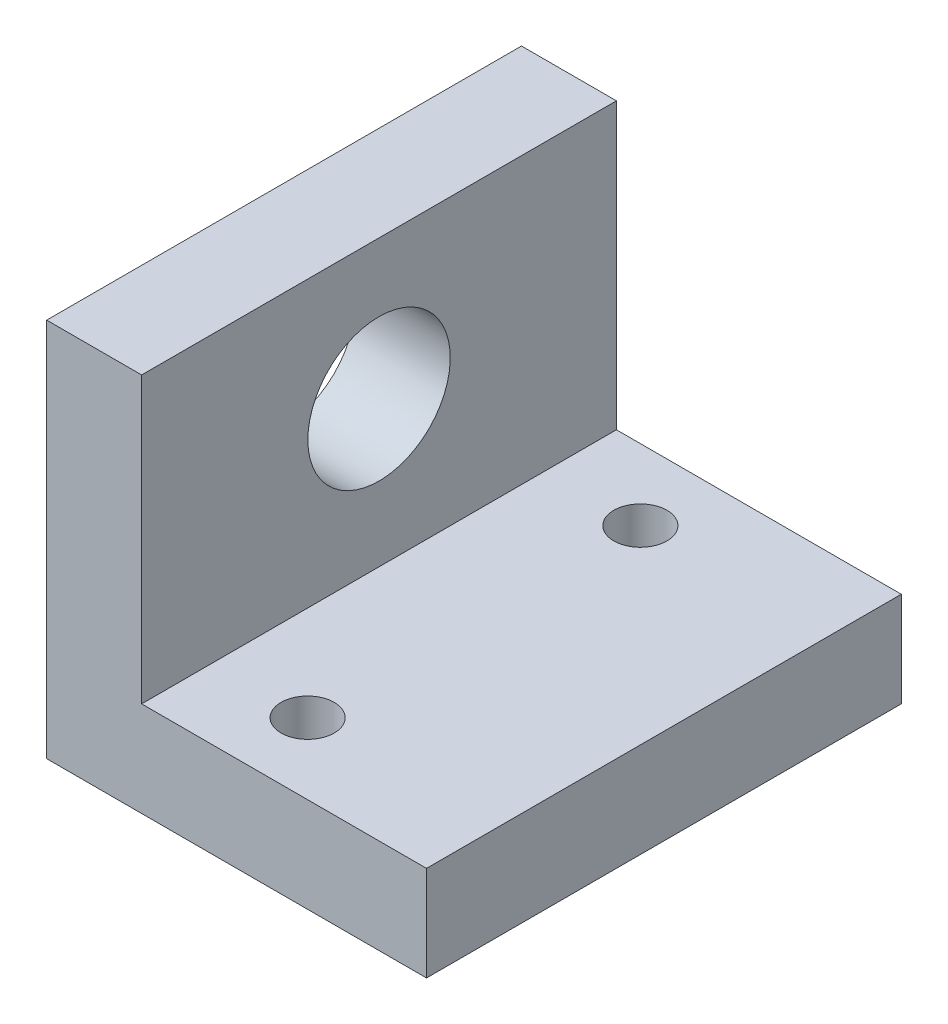
ISO-10303-21;
HEADER;
FILE_DESCRIPTION(('STEP AP214'),'2;1');
FILE_NAME('part.step','',(''),(''),'','','');
FILE_SCHEMA(('AUTOMOTIVE_DESIGN { 1 0 10303 214 1 1 1 1 }'));
ENDSEC;
DATA;
#1=APPLICATION_CONTEXT('core data for automotive mechanical design processes');
#2=APPLICATION_PROTOCOL_DEFINITION('international standard','automotive_design',2000,#1);
#3=PRODUCT_CONTEXT('',#1,'mechanical');
#4=PRODUCT('Part','Part','',(#3));
#5=PRODUCT_RELATED_PRODUCT_CATEGORY('part','',(#4));
#6=PRODUCT_DEFINITION_FORMATION('','',#4);
#7=PRODUCT_DEFINITION_CONTEXT('part definition',#1,'design');
#8=PRODUCT_DEFINITION('design','',#6,#7);
#9=PRODUCT_DEFINITION_SHAPE('','',#8);
#10=(LENGTH_UNIT() NAMED_UNIT(*) SI_UNIT(.MILLI.,.METRE.));
#11=(NAMED_UNIT(*) PLANE_ANGLE_UNIT() SI_UNIT($,.RADIAN.));
#12=(NAMED_UNIT(*) SI_UNIT($,.STERADIAN.) SOLID_ANGLE_UNIT());
#13=UNCERTAINTY_MEASURE_WITH_UNIT(LENGTH_MEASURE(1.E-05),#10,'distance_accuracy_value','');
#14=(GEOMETRIC_REPRESENTATION_CONTEXT(3) GLOBAL_UNCERTAINTY_ASSIGNED_CONTEXT((#13)) GLOBAL_UNIT_ASSIGNED_CONTEXT((#10,
#11,#12)) REPRESENTATION_CONTEXT('',''));
#15=CARTESIAN_POINT('',(0.,0.,0.));
#16=DIRECTION('',(0.,0.,1.));
#17=DIRECTION('',(1.,0.,0.));
#18=AXIS2_PLACEMENT_3D('',#15,#16,#17);
#19=CARTESIAN_POINT('',(25.4,0.,-31.75));
#20=DIRECTION('',(0.,-1.,0.));
#21=DIRECTION('',(1.,0.,0.));
#22=AXIS2_PLACEMENT_3D('',#19,#20,#21);
#23=PLANE('',#22);
#24=CARTESIAN_POINT('',(12.7,0.,-4.7498));
#25=DIRECTION('',(0.,1.,0.));
#26=DIRECTION('',(0.,0.,1.));
#27=AXIS2_PLACEMENT_3D('',#24,#25,#26);
#28=CIRCLE('',#27,1.778);
#29=CARTESIAN_POINT('',(12.7,0.,-2.9718));
#30=VERTEX_POINT('',#29);
#31=EDGE_CURVE('E192',#30,#30,#28,.T.);
#32=ORIENTED_EDGE('',*,*,#31,.T.);
#33=EDGE_LOOP('',(#32));
#34=FACE_BOUND('',#33,.T.);
#35=CARTESIAN_POINT('',(12.7,0.,-27.0002));
#36=DIRECTION('',(0.,1.,0.));
#37=DIRECTION('',(0.,0.,1.));
#38=AXIS2_PLACEMENT_3D('',#35,#36,#37);
#39=CIRCLE('',#38,1.778);
#40=CARTESIAN_POINT('',(12.7,0.,-25.2222));
#41=VERTEX_POINT('',#40);
#42=EDGE_CURVE('E200',#41,#41,#39,.T.);
#43=ORIENTED_EDGE('',*,*,#42,.T.);
#44=EDGE_LOOP('',(#43));
#45=FACE_BOUND('',#44,.T.);
#46=DIRECTION('',(1.,0.,0.));
#47=VECTOR('',#46,1.);
#48=CARTESIAN_POINT('',(25.4,0.,0.));
#49=LINE('',#48,#47);
#50=CARTESIAN_POINT('',(0.,0.,0.));
#51=VERTEX_POINT('',#50);
#52=CARTESIAN_POINT('',(25.4,0.,0.));
#53=VERTEX_POINT('',#52);
#54=EDGE_CURVE('E125',#51,#53,#49,.T.);
#55=ORIENTED_EDGE('',*,*,#54,.F.);
#56=DIRECTION('',(0.,0.,1.));
#57=VECTOR('',#56,1.);
#58=CARTESIAN_POINT('',(0.,0.,-31.75));
#59=LINE('',#58,#57);
#60=CARTESIAN_POINT('',(0.,0.,-31.75));
#61=VERTEX_POINT('',#60);
#62=EDGE_CURVE('E11',#61,#51,#59,.T.);
#63=ORIENTED_EDGE('',*,*,#62,.F.);
#64=DIRECTION('',(1.,0.,0.));
#65=VECTOR('',#64,1.);
#66=CARTESIAN_POINT('',(25.4,0.,-31.75));
#67=LINE('',#66,#65);
#68=CARTESIAN_POINT('',(25.4,0.,-31.75));
#69=VERTEX_POINT('',#68);
#70=EDGE_CURVE('E139',#61,#69,#67,.T.);
#71=ORIENTED_EDGE('',*,*,#70,.T.);
#72=DIRECTION('',(0.,0.,1.));
#73=VECTOR('',#72,1.);
#74=CARTESIAN_POINT('',(25.4,0.,-31.75));
#75=LINE('',#74,#73);
#76=EDGE_CURVE('E89',#69,#53,#75,.T.);
#77=ORIENTED_EDGE('',*,*,#76,.T.);
#78=EDGE_LOOP('',(#55,#63,#71,#77));
#79=FACE_BOUND('',#78,.T.);
#80=ADVANCED_FACE('F39',(#34,#45,#79),#23,.T.);
#81=CARTESIAN_POINT('',(0.,0.,-31.75));
#82=DIRECTION('',(-1.,0.,0.));
#83=DIRECTION('',(0.,0.,1.));
#84=AXIS2_PLACEMENT_3D('',#81,#82,#83);
#85=PLANE('',#84);
#86=CARTESIAN_POINT('',(0.,16.0782,-15.875));
#87=DIRECTION('',(-1.,0.,0.));
#88=DIRECTION('',(0.,0.,1.));
#89=AXIS2_PLACEMENT_3D('',#86,#87,#88);
#90=CIRCLE('',#89,4.7625);
#91=CARTESIAN_POINT('',(0.,16.0782,-11.1125));
#92=VERTEX_POINT('',#91);
#93=EDGE_CURVE('E203',#92,#92,#90,.T.);
#94=ORIENTED_EDGE('',*,*,#93,.F.);
#95=EDGE_LOOP('',(#94));
#96=FACE_BOUND('',#95,.T.);
#97=DIRECTION('',(0.,-1.,0.));
#98=VECTOR('',#97,1.);
#99=CARTESIAN_POINT('',(0.,0.,0.));
#100=LINE('',#99,#98);
#101=CARTESIAN_POINT('',(0.,25.4,0.));
#102=VERTEX_POINT('',#101);
#103=EDGE_CURVE('E137',#102,#51,#100,.T.);
#104=ORIENTED_EDGE('',*,*,#103,.F.);
#105=DIRECTION('',(0.,0.,1.));
#106=VECTOR('',#105,1.);
#107=CARTESIAN_POINT('',(0.,25.4,-31.75));
#108=LINE('',#107,#106);
#109=CARTESIAN_POINT('',(0.,25.4,-31.75));
#110=VERTEX_POINT('',#109);
#111=EDGE_CURVE('E48',#110,#102,#108,.T.);
#112=ORIENTED_EDGE('',*,*,#111,.F.);
#113=DIRECTION('',(0.,-1.,0.));
#114=VECTOR('',#113,1.);
#115=CARTESIAN_POINT('',(0.,0.,-31.75));
#116=LINE('',#115,#114);
#117=EDGE_CURVE('E115',#110,#61,#116,.T.);
#118=ORIENTED_EDGE('',*,*,#117,.T.);
#119=ORIENTED_EDGE('',*,*,#62,.T.);
#120=EDGE_LOOP('',(#104,#112,#118,#119));
#121=FACE_BOUND('',#120,.T.);
#122=ADVANCED_FACE('F148',(#96,#121),#85,.T.);
#123=CARTESIAN_POINT('',(0.,25.4,-31.75));
#124=DIRECTION('',(0.,1.,0.));
#125=DIRECTION('',(0.,0.,1.));
#126=AXIS2_PLACEMENT_3D('',#123,#124,#125);
#127=PLANE('',#126);
#128=DIRECTION('',(-1.,0.,0.));
#129=VECTOR('',#128,1.);
#130=CARTESIAN_POINT('',(0.,25.4,0.));
#131=LINE('',#130,#129);
#132=CARTESIAN_POINT('',(6.35,25.4,0.));
#133=VERTEX_POINT('',#132);
#134=EDGE_CURVE('E102',#133,#102,#131,.T.);
#135=ORIENTED_EDGE('',*,*,#134,.F.);
#136=DIRECTION('',(0.,0.,1.));
#137=VECTOR('',#136,1.);
#138=CARTESIAN_POINT('',(6.35,25.4,-31.75));
#139=LINE('',#138,#137);
#140=CARTESIAN_POINT('',(6.35,25.4,-31.75));
#141=VERTEX_POINT('',#140);
#142=EDGE_CURVE('E97',#141,#133,#139,.T.);
#143=ORIENTED_EDGE('',*,*,#142,.F.);
#144=DIRECTION('',(-1.,0.,0.));
#145=VECTOR('',#144,1.);
#146=CARTESIAN_POINT('',(0.,25.4,-31.75));
#147=LINE('',#146,#145);
#148=EDGE_CURVE('E100',#141,#110,#147,.T.);
#149=ORIENTED_EDGE('',*,*,#148,.T.);
#150=ORIENTED_EDGE('',*,*,#111,.T.);
#151=EDGE_LOOP('',(#135,#143,#149,#150));
#152=FACE_BOUND('',#151,.T.);
#153=ADVANCED_FACE('F99',(#152),#127,.T.);
#154=CARTESIAN_POINT('',(6.35,25.4,-31.75));
#155=DIRECTION('',(1.,0.,0.));
#156=DIRECTION('',(0.,1.,0.));
#157=AXIS2_PLACEMENT_3D('',#154,#155,#156);
#158=PLANE('',#157);
#159=CARTESIAN_POINT('',(6.35,16.0782,-15.875));
#160=DIRECTION('',(1.,0.,0.));
#161=DIRECTION('',(0.,1.,0.));
#162=AXIS2_PLACEMENT_3D('',#159,#160,#161);
#163=CIRCLE('',#162,4.7625);
#164=CARTESIAN_POINT('',(6.35,20.8407,-15.875));
#165=VERTEX_POINT('',#164);
#166=EDGE_CURVE('E42',#165,#165,#163,.T.);
#167=ORIENTED_EDGE('',*,*,#166,.F.);
#168=EDGE_LOOP('',(#167));
#169=FACE_BOUND('',#168,.T.);
#170=DIRECTION('',(0.,1.,0.));
#171=VECTOR('',#170,1.);
#172=CARTESIAN_POINT('',(6.35,25.4,0.));
#173=LINE('',#172,#171);
#174=CARTESIAN_POINT('',(6.35,6.35,0.));
#175=VERTEX_POINT('',#174);
#176=EDGE_CURVE('E134',#175,#133,#173,.T.);
#177=ORIENTED_EDGE('',*,*,#176,.F.);
#178=DIRECTION('',(0.,0.,1.));
#179=VECTOR('',#178,1.);
#180=CARTESIAN_POINT('',(6.35,6.35,-31.75));
#181=LINE('',#180,#179);
#182=CARTESIAN_POINT('',(6.35,6.35,-31.75));
#183=VERTEX_POINT('',#182);
#184=EDGE_CURVE('E107',#183,#175,#181,.T.);
#185=ORIENTED_EDGE('',*,*,#184,.F.);
#186=DIRECTION('',(0.,1.,0.));
#187=VECTOR('',#186,1.);
#188=CARTESIAN_POINT('',(6.35,25.4,-31.75));
#189=LINE('',#188,#187);
#190=EDGE_CURVE('E113',#183,#141,#189,.T.);
#191=ORIENTED_EDGE('',*,*,#190,.T.);
#192=ORIENTED_EDGE('',*,*,#142,.T.);
#193=EDGE_LOOP('',(#177,#185,#191,#192));
#194=FACE_BOUND('',#193,.T.);
#195=ADVANCED_FACE('F117',(#169,#194),#158,.T.);
#196=CARTESIAN_POINT('',(6.35,6.35,-31.75));
#197=DIRECTION('',(0.,1.,0.));
#198=DIRECTION('',(0.,0.,1.));
#199=AXIS2_PLACEMENT_3D('',#196,#197,#198);
#200=PLANE('',#199);
#201=CARTESIAN_POINT('',(12.7,6.35,-4.7498));
#202=DIRECTION('',(0.,1.,0.));
#203=DIRECTION('',(0.,0.,1.));
#204=AXIS2_PLACEMENT_3D('',#201,#202,#203);
#205=CIRCLE('',#204,1.778);
#206=CARTESIAN_POINT('',(12.7,6.35,-2.9718));
#207=VERTEX_POINT('',#206);
#208=EDGE_CURVE('E195',#207,#207,#205,.T.);
#209=ORIENTED_EDGE('',*,*,#208,.F.);
#210=EDGE_LOOP('',(#209));
#211=FACE_BOUND('',#210,.T.);
#212=CARTESIAN_POINT('',(12.7,6.35,-27.0002));
#213=DIRECTION('',(0.,1.,0.));
#214=DIRECTION('',(0.,0.,1.));
#215=AXIS2_PLACEMENT_3D('',#212,#213,#214);
#216=CIRCLE('',#215,1.778);
#217=CARTESIAN_POINT('',(12.7,6.35,-25.2222));
#218=VERTEX_POINT('',#217);
#219=EDGE_CURVE('E197',#218,#218,#216,.T.);
#220=ORIENTED_EDGE('',*,*,#219,.F.);
#221=EDGE_LOOP('',(#220));
#222=FACE_BOUND('',#221,.T.);
#223=DIRECTION('',(-1.,0.,0.));
#224=VECTOR('',#223,1.);
#225=CARTESIAN_POINT('',(6.35,6.35,0.));
#226=LINE('',#225,#224);
#227=CARTESIAN_POINT('',(25.4,6.35,0.));
#228=VERTEX_POINT('',#227);
#229=EDGE_CURVE('E131',#228,#175,#226,.T.);
#230=ORIENTED_EDGE('',*,*,#229,.F.);
#231=DIRECTION('',(0.,0.,1.));
#232=VECTOR('',#231,1.);
#233=CARTESIAN_POINT('',(25.4,6.35,-31.75));
#234=LINE('',#233,#232);
#235=CARTESIAN_POINT('',(25.4,6.35,-31.75));
#236=VERTEX_POINT('',#235);
#237=EDGE_CURVE('E143',#236,#228,#234,.T.);
#238=ORIENTED_EDGE('',*,*,#237,.F.);
#239=DIRECTION('',(-1.,0.,0.));
#240=VECTOR('',#239,1.);
#241=CARTESIAN_POINT('',(6.35,6.35,-31.75));
#242=LINE('',#241,#240);
#243=EDGE_CURVE('E118',#236,#183,#242,.T.);
#244=ORIENTED_EDGE('',*,*,#243,.T.);
#245=ORIENTED_EDGE('',*,*,#184,.T.);
#246=EDGE_LOOP('',(#230,#238,#244,#245));
#247=FACE_BOUND('',#246,.T.);
#248=ADVANCED_FACE('F165',(#211,#222,#247),#200,.T.);
#249=CARTESIAN_POINT('',(25.4,6.35,-31.75));
#250=DIRECTION('',(1.,0.,0.));
#251=DIRECTION('',(0.,0.,-1.));
#252=AXIS2_PLACEMENT_3D('',#249,#250,#251);
#253=PLANE('',#252);
#254=DIRECTION('',(0.,1.,0.));
#255=VECTOR('',#254,1.);
#256=CARTESIAN_POINT('',(25.4,6.35,0.));
#257=LINE('',#256,#255);
#258=EDGE_CURVE('E128',#53,#228,#257,.T.);
#259=ORIENTED_EDGE('',*,*,#258,.F.);
#260=ORIENTED_EDGE('',*,*,#76,.F.);
#261=DIRECTION('',(0.,1.,0.));
#262=VECTOR('',#261,1.);
#263=CARTESIAN_POINT('',(25.4,6.35,-31.75));
#264=LINE('',#263,#262);
#265=EDGE_CURVE('E120',#69,#236,#264,.T.);
#266=ORIENTED_EDGE('',*,*,#265,.T.);
#267=ORIENTED_EDGE('',*,*,#237,.T.);
#268=EDGE_LOOP('',(#259,#260,#266,#267));
#269=FACE_BOUND('',#268,.T.);
#270=ADVANCED_FACE('F144',(#269),#253,.T.);
#271=CARTESIAN_POINT('',(0.,0.,-31.75));
#272=DIRECTION('',(0.,0.,-1.));
#273=DIRECTION('',(-1.,0.,0.));
#274=AXIS2_PLACEMENT_3D('',#271,#272,#273);
#275=PLANE('',#274);
#276=ORIENTED_EDGE('',*,*,#70,.F.);
#277=ORIENTED_EDGE('',*,*,#117,.F.);
#278=ORIENTED_EDGE('',*,*,#148,.F.);
#279=ORIENTED_EDGE('',*,*,#190,.F.);
#280=ORIENTED_EDGE('',*,*,#243,.F.);
#281=ORIENTED_EDGE('',*,*,#265,.F.);
#282=EDGE_LOOP('',(#276,#277,#278,#279,#280,#281));
#283=FACE_BOUND('',#282,.T.);
#284=ADVANCED_FACE('F111',(#283),#275,.T.);
#285=CARTESIAN_POINT('',(0.,0.,0.));
#286=DIRECTION('',(0.,0.,-1.));
#287=DIRECTION('',(-1.,0.,0.));
#288=AXIS2_PLACEMENT_3D('',#285,#286,#287);
#289=PLANE('',#288);
#290=ORIENTED_EDGE('',*,*,#54,.T.);
#291=ORIENTED_EDGE('',*,*,#258,.T.);
#292=ORIENTED_EDGE('',*,*,#229,.T.);
#293=ORIENTED_EDGE('',*,*,#176,.T.);
#294=ORIENTED_EDGE('',*,*,#134,.T.);
#295=ORIENTED_EDGE('',*,*,#103,.T.);
#296=EDGE_LOOP('',(#290,#291,#292,#293,#294,#295));
#297=FACE_BOUND('',#296,.T.);
#298=ADVANCED_FACE('F147',(#297),#289,.F.);
#299=CARTESIAN_POINT('',(25.4,16.0782,-15.875));
#300=DIRECTION('',(-1.,0.,0.));
#301=DIRECTION('',(0.,0.,1.));
#302=AXIS2_PLACEMENT_3D('',#299,#300,#301);
#303=CYLINDRICAL_SURFACE('',#302,4.7625);
#304=ORIENTED_EDGE('',*,*,#166,.T.);
#305=EDGE_LOOP('',(#304));
#306=FACE_BOUND('',#305,.T.);
#307=ORIENTED_EDGE('',*,*,#93,.T.);
#308=EDGE_LOOP('',(#307));
#309=FACE_BOUND('',#308,.T.);
#310=ADVANCED_FACE('F175',(#306,#309),#303,.F.);
#311=CARTESIAN_POINT('',(12.7,0.,-27.0002));
#312=DIRECTION('',(0.,1.,0.));
#313=DIRECTION('',(0.,0.,1.));
#314=AXIS2_PLACEMENT_3D('',#311,#312,#313);
#315=CYLINDRICAL_SURFACE('',#314,1.778);
#316=ORIENTED_EDGE('',*,*,#42,.F.);
#317=EDGE_LOOP('',(#316));
#318=FACE_BOUND('',#317,.T.);
#319=ORIENTED_EDGE('',*,*,#219,.T.);
#320=EDGE_LOOP('',(#319));
#321=FACE_BOUND('',#320,.T.);
#322=ADVANCED_FACE('F179',(#318,#321),#315,.F.);
#323=CARTESIAN_POINT('',(12.7,0.,-4.7498));
#324=DIRECTION('',(0.,1.,0.));
#325=DIRECTION('',(0.,0.,1.));
#326=AXIS2_PLACEMENT_3D('',#323,#324,#325);
#327=CYLINDRICAL_SURFACE('',#326,1.778);
#328=ORIENTED_EDGE('',*,*,#31,.F.);
#329=EDGE_LOOP('',(#328));
#330=FACE_BOUND('',#329,.T.);
#331=ORIENTED_EDGE('',*,*,#208,.T.);
#332=EDGE_LOOP('',(#331));
#333=FACE_BOUND('',#332,.T.);
#334=ADVANCED_FACE('F183',(#330,#333),#327,.F.);
#335=CLOSED_SHELL('',(#80,#122,#153,#195,#248,#270,#284,#298,#310,#322,#334));
#336=MANIFOLD_SOLID_BREP('B2',#335);
#337=ADVANCED_BREP_SHAPE_REPRESENTATION('',(#18,#336),#14);
#338=SHAPE_DEFINITION_REPRESENTATION(#9,#337);
ENDSEC;
END-ISO-10303-21;
